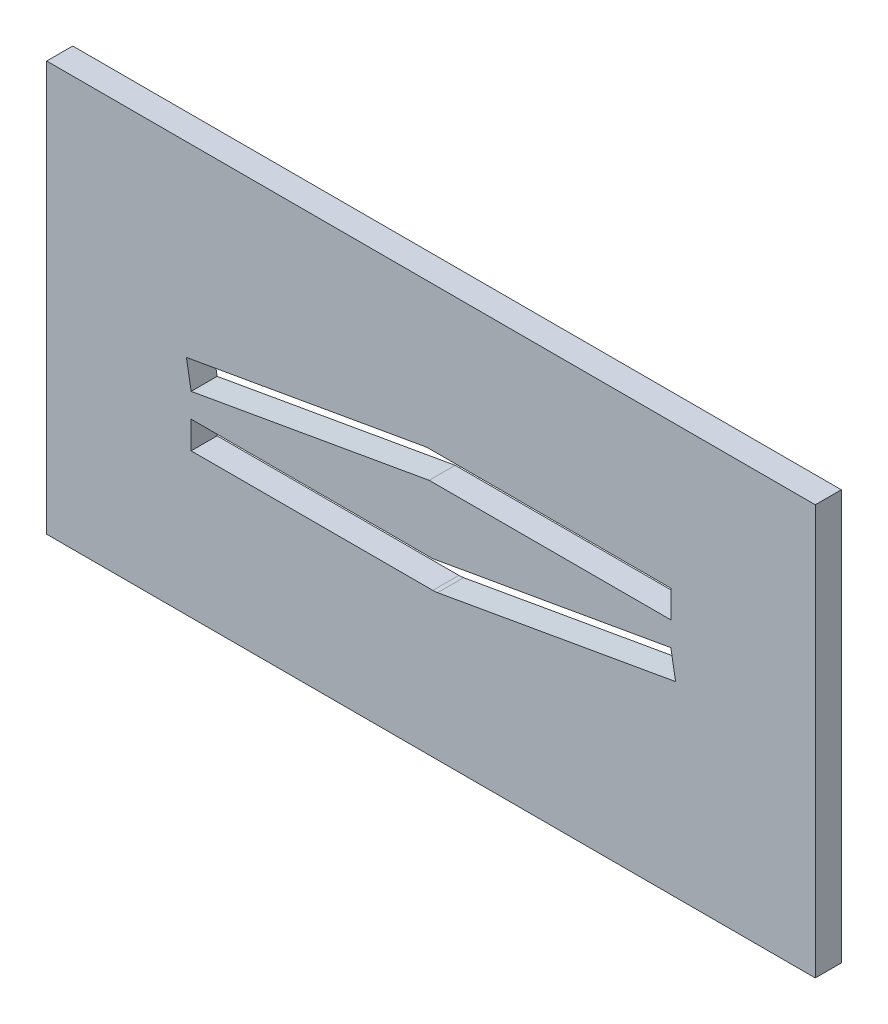
ISO-10303-21;
HEADER;
FILE_DESCRIPTION(('STEP AP214'),'2;1');
FILE_NAME('part.step','',(''),(''),'','','');
FILE_SCHEMA(('AUTOMOTIVE_DESIGN { 1 0 10303 214 1 1 1 1 }'));
ENDSEC;
DATA;
#1=APPLICATION_CONTEXT('core data for automotive mechanical design processes');
#2=APPLICATION_PROTOCOL_DEFINITION('international standard','automotive_design',2000,#1);
#3=PRODUCT_CONTEXT('',#1,'mechanical');
#4=PRODUCT('Part','Part','',(#3));
#5=PRODUCT_RELATED_PRODUCT_CATEGORY('part','',(#4));
#6=PRODUCT_DEFINITION_FORMATION('','',#4);
#7=PRODUCT_DEFINITION_CONTEXT('part definition',#1,'design');
#8=PRODUCT_DEFINITION('design','',#6,#7);
#9=PRODUCT_DEFINITION_SHAPE('','',#8);
#10=(LENGTH_UNIT() NAMED_UNIT(*) SI_UNIT(.MILLI.,.METRE.));
#11=(NAMED_UNIT(*) PLANE_ANGLE_UNIT() SI_UNIT($,.RADIAN.));
#12=(NAMED_UNIT(*) SI_UNIT($,.STERADIAN.) SOLID_ANGLE_UNIT());
#13=UNCERTAINTY_MEASURE_WITH_UNIT(LENGTH_MEASURE(1.E-05),#10,'distance_accuracy_value','');
#14=(GEOMETRIC_REPRESENTATION_CONTEXT(3) GLOBAL_UNCERTAINTY_ASSIGNED_CONTEXT((#13)) GLOBAL_UNIT_ASSIGNED_CONTEXT((#10,
#11,#12)) REPRESENTATION_CONTEXT('',''));
#15=CARTESIAN_POINT('',(0.,0.,0.));
#16=DIRECTION('',(0.,0.,1.));
#17=DIRECTION('',(1.,0.,0.));
#18=AXIS2_PLACEMENT_3D('',#15,#16,#17);
#19=CARTESIAN_POINT('',(0.,0.,2.7));
#20=DIRECTION('',(0.,0.,1.));
#21=DIRECTION('',(1.,0.,0.));
#22=AXIS2_PLACEMENT_3D('',#19,#20,#21);
#23=PLANE('',#22);
#24=DIRECTION('',(0.,-1.,0.));
#25=VECTOR('',#24,1.);
#26=CARTESIAN_POINT('',(-39.9048674522936,21.2788935686915,2.7));
#27=LINE('',#26,#25);
#28=CARTESIAN_POINT('',(-39.9048674522936,21.2788935686915,2.7));
#29=VERTEX_POINT('',#28);
#30=CARTESIAN_POINT('',(-39.9048674522936,-21.2788935686915,2.7));
#31=VERTEX_POINT('',#30);
#32=EDGE_CURVE('E270',#29,#31,#27,.T.);
#33=ORIENTED_EDGE('',*,*,#32,.T.);
#34=DIRECTION('',(1.,0.,0.));
#35=VECTOR('',#34,1.);
#36=CARTESIAN_POINT('',(-39.9048674522936,-21.2788935686915,2.7));
#37=LINE('',#36,#35);
#38=CARTESIAN_POINT('',(39.9048674522936,-21.2788935686915,2.7));
#39=VERTEX_POINT('',#38);
#40=EDGE_CURVE('E273',#31,#39,#37,.T.);
#41=ORIENTED_EDGE('',*,*,#40,.T.);
#42=DIRECTION('',(0.,1.,0.));
#43=VECTOR('',#42,1.);
#44=CARTESIAN_POINT('',(39.9048674522936,21.2788935686915,2.7));
#45=LINE('',#44,#43);
#46=CARTESIAN_POINT('',(39.9048674522936,21.2788935686915,2.7));
#47=VERTEX_POINT('',#46);
#48=EDGE_CURVE('E276',#39,#47,#45,.T.);
#49=ORIENTED_EDGE('',*,*,#48,.T.);
#50=DIRECTION('',(-1.,0.,0.));
#51=VECTOR('',#50,1.);
#52=CARTESIAN_POINT('',(-39.9048674522936,21.2788935686915,2.7));
#53=LINE('',#52,#51);
#54=EDGE_CURVE('E278',#47,#29,#53,.T.);
#55=ORIENTED_EDGE('',*,*,#54,.T.);
#56=EDGE_LOOP('',(#33,#41,#49,#55));
#57=FACE_BOUND('',#56,.T.);
#58=DIRECTION('',(-0.984807753012208,-0.173648177666931,0.));
#59=VECTOR('',#58,1.);
#60=CARTESIAN_POINT('',(-25.3997647586444,1.87780852739333,2.7));
#61=LINE('',#60,#59);
#62=CARTESIAN_POINT('',(-0.685525792640803,6.23559566477625,2.7));
#63=VERTEX_POINT('',#62);
#64=CARTESIAN_POINT('',(-25.3997647586444,1.87780852739333,2.7));
#65=VERTEX_POINT('',#64);
#66=EDGE_CURVE('E220',#63,#65,#61,.T.);
#67=ORIENTED_EDGE('',*,*,#66,.F.);
#68=DIRECTION('',(-0.996194698091746,-0.0871557427476577,0.));
#69=VECTOR('',#68,1.);
#70=CARTESIAN_POINT('',(-0.685525792640803,6.23559566477625,2.7));
#71=LINE('',#70,#69);
#72=CARTESIAN_POINT('',(-0.19062848629005,6.27889356869146,2.7));
#73=VERTEX_POINT('',#72);
#74=EDGE_CURVE('E218',#73,#63,#71,.T.);
#75=ORIENTED_EDGE('',*,*,#74,.F.);
#76=DIRECTION('',(-1.,0.,0.));
#77=VECTOR('',#76,1.);
#78=CARTESIAN_POINT('',(-0.19062848629005,6.27889356869146,2.7));
#79=LINE('',#78,#77);
#80=CARTESIAN_POINT('',(24.9048674522936,6.27889356869146,2.7));
#81=VERTEX_POINT('',#80);
#82=EDGE_CURVE('E232',#81,#73,#79,.T.);
#83=ORIENTED_EDGE('',*,*,#82,.F.);
#84=DIRECTION('',(0.,1.,0.));
#85=VECTOR('',#84,1.);
#86=CARTESIAN_POINT('',(24.9048674522936,3.42889356869146,2.7));
#87=LINE('',#86,#85);
#88=CARTESIAN_POINT('',(24.9048674522936,3.42889356869146,2.7));
#89=VERTEX_POINT('',#88);
#90=EDGE_CURVE('E229',#89,#81,#87,.T.);
#91=ORIENTED_EDGE('',*,*,#90,.F.);
#92=DIRECTION('',(1.,0.,0.));
#93=VECTOR('',#92,1.);
#94=CARTESIAN_POINT('',(-0.19062848629005,3.42889356869146,2.7));
#95=LINE('',#94,#93);
#96=CARTESIAN_POINT('',(-0.19062848629005,3.42889356869146,2.7));
#97=VERTEX_POINT('',#96);
#98=EDGE_CURVE('E227',#97,#89,#95,.T.);
#99=ORIENTED_EDGE('',*,*,#98,.F.);
#100=DIRECTION('',(0.984807753012208,0.173648177666931,0.));
#101=VECTOR('',#100,1.);
#102=CARTESIAN_POINT('',(-24.9048674522936,-0.928893568691461,2.7));
#103=LINE('',#102,#101);
#104=CARTESIAN_POINT('',(-24.9048674522936,-0.928893568691461,2.7));
#105=VERTEX_POINT('',#104);
#106=EDGE_CURVE('E225',#105,#97,#103,.T.);
#107=ORIENTED_EDGE('',*,*,#106,.F.);
#108=DIRECTION('',(0.173648177666933,-0.984807753012208,0.));
#109=VECTOR('',#108,1.);
#110=CARTESIAN_POINT('',(-24.9048674522936,-0.928893568691461,2.7));
#111=LINE('',#110,#109);
#112=EDGE_CURVE('E223',#65,#105,#111,.T.);
#113=ORIENTED_EDGE('',*,*,#112,.F.);
#114=EDGE_LOOP('',(#67,#75,#83,#91,#99,#107,#113));
#115=FACE_BOUND('',#114,.T.);
#116=DIRECTION('',(-0.984807753012208,-0.173648177666931,0.));
#117=VECTOR('',#116,1.);
#118=CARTESIAN_POINT('',(0.190628486290044,-3.42889356869146,2.7));
#119=LINE('',#118,#117);
#120=CARTESIAN_POINT('',(24.9048674522936,0.928893568691459,2.7));
#121=VERTEX_POINT('',#120);
#122=CARTESIAN_POINT('',(0.190628486290044,-3.42889356869146,2.7));
#123=VERTEX_POINT('',#122);
#124=EDGE_CURVE('E168',#121,#123,#119,.T.);
#125=ORIENTED_EDGE('',*,*,#124,.F.);
#126=DIRECTION('',(-0.173648177666932,0.984807753012208,0.));
#127=VECTOR('',#126,1.);
#128=CARTESIAN_POINT('',(24.9048674522936,0.928893568691459,2.7));
#129=LINE('',#128,#127);
#130=CARTESIAN_POINT('',(25.3997647586444,-1.87780852739333,2.7));
#131=VERTEX_POINT('',#130);
#132=EDGE_CURVE('E160',#131,#121,#129,.T.);
#133=ORIENTED_EDGE('',*,*,#132,.F.);
#134=DIRECTION('',(0.984807753012208,0.173648177666931,0.));
#135=VECTOR('',#134,1.);
#136=CARTESIAN_POINT('',(0.685525792640796,-6.23559566477625,2.7));
#137=LINE('',#136,#135);
#138=CARTESIAN_POINT('',(0.685525792640796,-6.23559566477625,2.7));
#139=VERTEX_POINT('',#138);
#140=EDGE_CURVE('E191',#139,#131,#137,.T.);
#141=ORIENTED_EDGE('',*,*,#140,.F.);
#142=DIRECTION('',(0.996194698091746,0.0871557427476577,0.));
#143=VECTOR('',#142,1.);
#144=CARTESIAN_POINT('',(0.190628486290044,-6.27889356869146,2.7));
#145=LINE('',#144,#143);
#146=CARTESIAN_POINT('',(0.190628486290044,-6.27889356869146,2.7));
#147=VERTEX_POINT('',#146);
#148=EDGE_CURVE('E189',#147,#139,#145,.T.);
#149=ORIENTED_EDGE('',*,*,#148,.F.);
#150=DIRECTION('',(1.,0.,0.));
#151=VECTOR('',#150,1.);
#152=CARTESIAN_POINT('',(-24.9048674522936,-6.27889356869146,2.7));
#153=LINE('',#152,#151);
#154=CARTESIAN_POINT('',(-24.9048674522936,-6.27889356869146,2.7));
#155=VERTEX_POINT('',#154);
#156=EDGE_CURVE('E187',#155,#147,#153,.T.);
#157=ORIENTED_EDGE('',*,*,#156,.F.);
#158=DIRECTION('',(0.,-1.,0.));
#159=VECTOR('',#158,1.);
#160=CARTESIAN_POINT('',(-24.9048674522936,-3.42889356869146,2.7));
#161=LINE('',#160,#159);
#162=CARTESIAN_POINT('',(-24.9048674522936,-3.42889356869146,2.7));
#163=VERTEX_POINT('',#162);
#164=EDGE_CURVE('E183',#163,#155,#161,.T.);
#165=ORIENTED_EDGE('',*,*,#164,.F.);
#166=DIRECTION('',(-1.,0.,0.));
#167=VECTOR('',#166,1.);
#168=CARTESIAN_POINT('',(-24.9048674522936,-3.42889356869146,2.7));
#169=LINE('',#168,#167);
#170=EDGE_CURVE('E181',#123,#163,#169,.T.);
#171=ORIENTED_EDGE('',*,*,#170,.F.);
#172=EDGE_LOOP('',(#125,#133,#141,#149,#157,#165,#171));
#173=FACE_BOUND('',#172,.T.);
#174=ADVANCED_FACE('F35',(#57,#115,#173),#23,.T.);
#175=CARTESIAN_POINT('',(0.,0.,0.));
#176=DIRECTION('',(0.,0.,1.));
#177=DIRECTION('',(1.,0.,0.));
#178=AXIS2_PLACEMENT_3D('',#175,#176,#177);
#179=PLANE('',#178);
#180=DIRECTION('',(-0.996194698091746,-0.0871557427476577,0.));
#181=VECTOR('',#180,1.);
#182=CARTESIAN_POINT('',(-0.685525792640803,6.23559566477625,0.));
#183=LINE('',#182,#181);
#184=CARTESIAN_POINT('',(-0.19062848629005,6.27889356869146,0.));
#185=VERTEX_POINT('',#184);
#186=CARTESIAN_POINT('',(-0.685525792640803,6.23559566477625,0.));
#187=VERTEX_POINT('',#186);
#188=EDGE_CURVE('E176',#185,#187,#183,.T.);
#189=ORIENTED_EDGE('',*,*,#188,.T.);
#190=DIRECTION('',(-0.984807753012208,-0.173648177666931,0.));
#191=VECTOR('',#190,1.);
#192=CARTESIAN_POINT('',(-25.3997647586444,1.87780852739333,0.));
#193=LINE('',#192,#191);
#194=CARTESIAN_POINT('',(-25.3997647586444,1.87780852739333,0.));
#195=VERTEX_POINT('',#194);
#196=EDGE_CURVE('E237',#187,#195,#193,.T.);
#197=ORIENTED_EDGE('',*,*,#196,.T.);
#198=DIRECTION('',(0.173648177666933,-0.984807753012208,0.));
#199=VECTOR('',#198,1.);
#200=CARTESIAN_POINT('',(-24.9048674522936,-0.928893568691461,0.));
#201=LINE('',#200,#199);
#202=CARTESIAN_POINT('',(-24.9048674522936,-0.928893568691461,0.));
#203=VERTEX_POINT('',#202);
#204=EDGE_CURVE('E240',#195,#203,#201,.T.);
#205=ORIENTED_EDGE('',*,*,#204,.T.);
#206=DIRECTION('',(0.984807753012208,0.173648177666931,0.));
#207=VECTOR('',#206,1.);
#208=CARTESIAN_POINT('',(-24.9048674522936,-0.928893568691461,0.));
#209=LINE('',#208,#207);
#210=CARTESIAN_POINT('',(-0.19062848629005,3.42889356869146,0.));
#211=VERTEX_POINT('',#210);
#212=EDGE_CURVE('E243',#203,#211,#209,.T.);
#213=ORIENTED_EDGE('',*,*,#212,.T.);
#214=DIRECTION('',(1.,0.,0.));
#215=VECTOR('',#214,1.);
#216=CARTESIAN_POINT('',(-0.19062848629005,3.42889356869146,0.));
#217=LINE('',#216,#215);
#218=CARTESIAN_POINT('',(24.9048674522936,3.42889356869146,0.));
#219=VERTEX_POINT('',#218);
#220=EDGE_CURVE('E246',#211,#219,#217,.T.);
#221=ORIENTED_EDGE('',*,*,#220,.T.);
#222=DIRECTION('',(0.,1.,0.));
#223=VECTOR('',#222,1.);
#224=CARTESIAN_POINT('',(24.9048674522936,3.42889356869146,0.));
#225=LINE('',#224,#223);
#226=CARTESIAN_POINT('',(24.9048674522936,6.27889356869146,0.));
#227=VERTEX_POINT('',#226);
#228=EDGE_CURVE('E249',#219,#227,#225,.T.);
#229=ORIENTED_EDGE('',*,*,#228,.T.);
#230=DIRECTION('',(-1.,0.,0.));
#231=VECTOR('',#230,1.);
#232=CARTESIAN_POINT('',(-0.19062848629005,6.27889356869146,0.));
#233=LINE('',#232,#231);
#234=EDGE_CURVE('E221',#227,#185,#233,.T.);
#235=ORIENTED_EDGE('',*,*,#234,.T.);
#236=EDGE_LOOP('',(#189,#197,#205,#213,#221,#229,#235));
#237=FACE_BOUND('',#236,.T.);
#238=DIRECTION('',(0.,-1.,0.));
#239=VECTOR('',#238,1.);
#240=CARTESIAN_POINT('',(-39.9048674522936,21.2788935686915,0.));
#241=LINE('',#240,#239);
#242=CARTESIAN_POINT('',(-39.9048674522936,21.2788935686915,0.));
#243=VERTEX_POINT('',#242);
#244=CARTESIAN_POINT('',(-39.9048674522936,-21.2788935686915,0.));
#245=VERTEX_POINT('',#244);
#246=EDGE_CURVE('E269',#243,#245,#241,.T.);
#247=ORIENTED_EDGE('',*,*,#246,.F.);
#248=DIRECTION('',(-1.,0.,0.));
#249=VECTOR('',#248,1.);
#250=CARTESIAN_POINT('',(-39.9048674522936,21.2788935686915,0.));
#251=LINE('',#250,#249);
#252=CARTESIAN_POINT('',(39.9048674522936,21.2788935686915,0.));
#253=VERTEX_POINT('',#252);
#254=EDGE_CURVE('E274',#253,#243,#251,.T.);
#255=ORIENTED_EDGE('',*,*,#254,.F.);
#256=DIRECTION('',(0.,1.,0.));
#257=VECTOR('',#256,1.);
#258=CARTESIAN_POINT('',(39.9048674522936,21.2788935686915,0.));
#259=LINE('',#258,#257);
#260=CARTESIAN_POINT('',(39.9048674522936,-21.2788935686915,0.));
#261=VERTEX_POINT('',#260);
#262=EDGE_CURVE('E285',#261,#253,#259,.T.);
#263=ORIENTED_EDGE('',*,*,#262,.F.);
#264=DIRECTION('',(1.,0.,0.));
#265=VECTOR('',#264,1.);
#266=CARTESIAN_POINT('',(-39.9048674522936,-21.2788935686915,0.));
#267=LINE('',#266,#265);
#268=EDGE_CURVE('E283',#245,#261,#267,.T.);
#269=ORIENTED_EDGE('',*,*,#268,.F.);
#270=EDGE_LOOP('',(#247,#255,#263,#269));
#271=FACE_BOUND('',#270,.T.);
#272=DIRECTION('',(-0.173648177666932,0.984807753012208,0.));
#273=VECTOR('',#272,1.);
#274=CARTESIAN_POINT('',(24.9048674522936,0.928893568691459,0.));
#275=LINE('',#274,#273);
#276=CARTESIAN_POINT('',(25.3997647586444,-1.87780852739333,0.));
#277=VERTEX_POINT('',#276);
#278=CARTESIAN_POINT('',(24.9048674522936,0.928893568691459,0.));
#279=VERTEX_POINT('',#278);
#280=EDGE_CURVE('E58',#277,#279,#275,.T.);
#281=ORIENTED_EDGE('',*,*,#280,.T.);
#282=DIRECTION('',(-0.984807753012208,-0.173648177666931,0.));
#283=VECTOR('',#282,1.);
#284=CARTESIAN_POINT('',(0.190628486290044,-3.42889356869146,0.));
#285=LINE('',#284,#283);
#286=CARTESIAN_POINT('',(0.190628486290044,-3.42889356869146,0.));
#287=VERTEX_POINT('',#286);
#288=EDGE_CURVE('E175',#279,#287,#285,.T.);
#289=ORIENTED_EDGE('',*,*,#288,.T.);
#290=DIRECTION('',(-1.,0.,0.));
#291=VECTOR('',#290,1.);
#292=CARTESIAN_POINT('',(-24.9048674522936,-3.42889356869146,0.));
#293=LINE('',#292,#291);
#294=CARTESIAN_POINT('',(-24.9048674522936,-3.42889356869146,0.));
#295=VERTEX_POINT('',#294);
#296=EDGE_CURVE('E195',#287,#295,#293,.T.);
#297=ORIENTED_EDGE('',*,*,#296,.T.);
#298=DIRECTION('',(0.,-1.,0.));
#299=VECTOR('',#298,1.);
#300=CARTESIAN_POINT('',(-24.9048674522936,-3.42889356869146,0.));
#301=LINE('',#300,#299);
#302=CARTESIAN_POINT('',(-24.9048674522936,-6.27889356869146,0.));
#303=VERTEX_POINT('',#302);
#304=EDGE_CURVE('E198',#295,#303,#301,.T.);
#305=ORIENTED_EDGE('',*,*,#304,.T.);
#306=DIRECTION('',(1.,0.,0.));
#307=VECTOR('',#306,1.);
#308=CARTESIAN_POINT('',(-24.9048674522936,-6.27889356869146,0.));
#309=LINE('',#308,#307);
#310=CARTESIAN_POINT('',(0.190628486290044,-6.27889356869146,0.));
#311=VERTEX_POINT('',#310);
#312=EDGE_CURVE('E201',#303,#311,#309,.T.);
#313=ORIENTED_EDGE('',*,*,#312,.T.);
#314=DIRECTION('',(0.996194698091746,0.0871557427476577,0.));
#315=VECTOR('',#314,1.);
#316=CARTESIAN_POINT('',(0.190628486290044,-6.27889356869146,0.));
#317=LINE('',#316,#315);
#318=CARTESIAN_POINT('',(0.685525792640796,-6.23559566477625,0.));
#319=VERTEX_POINT('',#318);
#320=EDGE_CURVE('E204',#311,#319,#317,.T.);
#321=ORIENTED_EDGE('',*,*,#320,.T.);
#322=DIRECTION('',(0.984807753012208,0.173648177666931,0.));
#323=VECTOR('',#322,1.);
#324=CARTESIAN_POINT('',(0.685525792640796,-6.23559566477625,0.));
#325=LINE('',#324,#323);
#326=EDGE_CURVE('E169',#319,#277,#325,.T.);
#327=ORIENTED_EDGE('',*,*,#326,.T.);
#328=EDGE_LOOP('',(#281,#289,#297,#305,#313,#321,#327));
#329=FACE_BOUND('',#328,.T.);
#330=ADVANCED_FACE('F303',(#237,#271,#329),#179,.F.);
#331=CARTESIAN_POINT('',(-39.9048674522936,21.2788935686915,2.7));
#332=DIRECTION('',(1.,0.,0.));
#333=DIRECTION('',(0.,0.,-1.));
#334=AXIS2_PLACEMENT_3D('',#331,#332,#333);
#335=PLANE('',#334);
#336=ORIENTED_EDGE('',*,*,#246,.T.);
#337=DIRECTION('',(0.,0.,-1.));
#338=VECTOR('',#337,1.);
#339=CARTESIAN_POINT('',(-39.9048674522936,-21.2788935686915,2.7));
#340=LINE('',#339,#338);
#341=EDGE_CURVE('E11',#31,#245,#340,.T.);
#342=ORIENTED_EDGE('',*,*,#341,.F.);
#343=ORIENTED_EDGE('',*,*,#32,.F.);
#344=DIRECTION('',(0.,0.,-1.));
#345=VECTOR('',#344,1.);
#346=CARTESIAN_POINT('',(-39.9048674522936,21.2788935686915,2.7));
#347=LINE('',#346,#345);
#348=EDGE_CURVE('E280',#29,#243,#347,.T.);
#349=ORIENTED_EDGE('',*,*,#348,.T.);
#350=EDGE_LOOP('',(#336,#342,#343,#349));
#351=FACE_BOUND('',#350,.T.);
#352=ADVANCED_FACE('F37',(#351),#335,.F.);
#353=CARTESIAN_POINT('',(-39.9048674522936,-21.2788935686915,2.7));
#354=DIRECTION('',(0.,1.,0.));
#355=DIRECTION('',(0.,0.,1.));
#356=AXIS2_PLACEMENT_3D('',#353,#354,#355);
#357=PLANE('',#356);
#358=ORIENTED_EDGE('',*,*,#268,.T.);
#359=DIRECTION('',(0.,0.,-1.));
#360=VECTOR('',#359,1.);
#361=CARTESIAN_POINT('',(39.9048674522936,-21.2788935686915,2.7));
#362=LINE('',#361,#360);
#363=EDGE_CURVE('E43',#39,#261,#362,.T.);
#364=ORIENTED_EDGE('',*,*,#363,.F.);
#365=ORIENTED_EDGE('',*,*,#40,.F.);
#366=ORIENTED_EDGE('',*,*,#341,.T.);
#367=EDGE_LOOP('',(#358,#364,#365,#366));
#368=FACE_BOUND('',#367,.T.);
#369=ADVANCED_FACE('F314',(#368),#357,.F.);
#370=CARTESIAN_POINT('',(39.9048674522936,21.2788935686915,2.7));
#371=DIRECTION('',(-1.,0.,0.));
#372=DIRECTION('',(0.,0.,1.));
#373=AXIS2_PLACEMENT_3D('',#370,#371,#372);
#374=PLANE('',#373);
#375=ORIENTED_EDGE('',*,*,#262,.T.);
#376=DIRECTION('',(0.,0.,-1.));
#377=VECTOR('',#376,1.);
#378=CARTESIAN_POINT('',(39.9048674522936,21.2788935686915,2.7));
#379=LINE('',#378,#377);
#380=EDGE_CURVE('E290',#47,#253,#379,.T.);
#381=ORIENTED_EDGE('',*,*,#380,.F.);
#382=ORIENTED_EDGE('',*,*,#48,.F.);
#383=ORIENTED_EDGE('',*,*,#363,.T.);
#384=EDGE_LOOP('',(#375,#381,#382,#383));
#385=FACE_BOUND('',#384,.T.);
#386=ADVANCED_FACE('F297',(#385),#374,.F.);
#387=CARTESIAN_POINT('',(-39.9048674522936,21.2788935686915,2.7));
#388=DIRECTION('',(0.,-1.,0.));
#389=DIRECTION('',(0.,0.,-1.));
#390=AXIS2_PLACEMENT_3D('',#387,#388,#389);
#391=PLANE('',#390);
#392=ORIENTED_EDGE('',*,*,#254,.T.);
#393=ORIENTED_EDGE('',*,*,#348,.F.);
#394=ORIENTED_EDGE('',*,*,#54,.F.);
#395=ORIENTED_EDGE('',*,*,#380,.T.);
#396=EDGE_LOOP('',(#392,#393,#394,#395));
#397=FACE_BOUND('',#396,.T.);
#398=ADVANCED_FACE('F307',(#397),#391,.F.);
#399=CARTESIAN_POINT('',(-0.685525792640803,6.23559566477625,2.7));
#400=DIRECTION('',(0.0871557427476577,-0.996194698091746,0.));
#401=DIRECTION('',(0.996194698091746,0.0871557427476577,0.));
#402=AXIS2_PLACEMENT_3D('',#399,#400,#401);
#403=PLANE('',#402);
#404=ORIENTED_EDGE('',*,*,#188,.F.);
#405=DIRECTION('',(0.,0.,-1.));
#406=VECTOR('',#405,1.);
#407=CARTESIAN_POINT('',(-0.19062848629005,6.27889356869146,2.7));
#408=LINE('',#407,#406);
#409=EDGE_CURVE('E234',#73,#185,#408,.T.);
#410=ORIENTED_EDGE('',*,*,#409,.F.);
#411=ORIENTED_EDGE('',*,*,#74,.T.);
#412=DIRECTION('',(0.,0.,-1.));
#413=VECTOR('',#412,1.);
#414=CARTESIAN_POINT('',(-0.685525792640803,6.23559566477625,2.7));
#415=LINE('',#414,#413);
#416=EDGE_CURVE('E266',#63,#187,#415,.T.);
#417=ORIENTED_EDGE('',*,*,#416,.T.);
#418=EDGE_LOOP('',(#404,#410,#411,#417));
#419=FACE_BOUND('',#418,.T.);
#420=ADVANCED_FACE('F329',(#419),#403,.T.);
#421=CARTESIAN_POINT('',(-25.3997647586444,1.87780852739333,2.7));
#422=DIRECTION('',(0.173648177666931,-0.984807753012208,0.));
#423=DIRECTION('',(0.984807753012208,0.173648177666931,0.));
#424=AXIS2_PLACEMENT_3D('',#421,#422,#423);
#425=PLANE('',#424);
#426=ORIENTED_EDGE('',*,*,#196,.F.);
#427=ORIENTED_EDGE('',*,*,#416,.F.);
#428=ORIENTED_EDGE('',*,*,#66,.T.);
#429=DIRECTION('',(0.,0.,-1.));
#430=VECTOR('',#429,1.);
#431=CARTESIAN_POINT('',(-25.3997647586444,1.87780852739333,2.7));
#432=LINE('',#431,#430);
#433=EDGE_CURVE('E264',#65,#195,#432,.T.);
#434=ORIENTED_EDGE('',*,*,#433,.T.);
#435=EDGE_LOOP('',(#426,#427,#428,#434));
#436=FACE_BOUND('',#435,.T.);
#437=ADVANCED_FACE('F336',(#436),#425,.T.);
#438=CARTESIAN_POINT('',(-24.9048674522936,-0.928893568691461,2.7));
#439=DIRECTION('',(0.984807753012208,0.173648177666933,0.));
#440=DIRECTION('',(-0.173648177666933,0.984807753012208,0.));
#441=AXIS2_PLACEMENT_3D('',#438,#439,#440);
#442=PLANE('',#441);
#443=ORIENTED_EDGE('',*,*,#204,.F.);
#444=ORIENTED_EDGE('',*,*,#433,.F.);
#445=ORIENTED_EDGE('',*,*,#112,.T.);
#446=DIRECTION('',(0.,0.,-1.));
#447=VECTOR('',#446,1.);
#448=CARTESIAN_POINT('',(-24.9048674522936,-0.928893568691461,2.7));
#449=LINE('',#448,#447);
#450=EDGE_CURVE('E262',#105,#203,#449,.T.);
#451=ORIENTED_EDGE('',*,*,#450,.T.);
#452=EDGE_LOOP('',(#443,#444,#445,#451));
#453=FACE_BOUND('',#452,.T.);
#454=ADVANCED_FACE('F341',(#453),#442,.T.);
#455=CARTESIAN_POINT('',(-24.9048674522936,-0.928893568691461,2.7));
#456=DIRECTION('',(-0.173648177666931,0.984807753012208,0.));
#457=DIRECTION('',(-0.984807753012208,-0.173648177666931,0.));
#458=AXIS2_PLACEMENT_3D('',#455,#456,#457);
#459=PLANE('',#458);
#460=ORIENTED_EDGE('',*,*,#212,.F.);
#461=ORIENTED_EDGE('',*,*,#450,.F.);
#462=ORIENTED_EDGE('',*,*,#106,.T.);
#463=DIRECTION('',(0.,0.,-1.));
#464=VECTOR('',#463,1.);
#465=CARTESIAN_POINT('',(-0.19062848629005,3.42889356869146,2.7));
#466=LINE('',#465,#464);
#467=EDGE_CURVE('E260',#97,#211,#466,.T.);
#468=ORIENTED_EDGE('',*,*,#467,.T.);
#469=EDGE_LOOP('',(#460,#461,#462,#468));
#470=FACE_BOUND('',#469,.T.);
#471=ADVANCED_FACE('F366',(#470),#459,.T.);
#472=CARTESIAN_POINT('',(-0.19062848629005,3.42889356869146,2.7));
#473=DIRECTION('',(0.,1.,0.));
#474=DIRECTION('',(0.,0.,1.));
#475=AXIS2_PLACEMENT_3D('',#472,#473,#474);
#476=PLANE('',#475);
#477=ORIENTED_EDGE('',*,*,#220,.F.);
#478=ORIENTED_EDGE('',*,*,#467,.F.);
#479=ORIENTED_EDGE('',*,*,#98,.T.);
#480=DIRECTION('',(0.,0.,-1.));
#481=VECTOR('',#480,1.);
#482=CARTESIAN_POINT('',(24.9048674522936,3.42889356869146,2.7));
#483=LINE('',#482,#481);
#484=EDGE_CURVE('E258',#89,#219,#483,.T.);
#485=ORIENTED_EDGE('',*,*,#484,.T.);
#486=EDGE_LOOP('',(#477,#478,#479,#485));
#487=FACE_BOUND('',#486,.T.);
#488=ADVANCED_FACE('F369',(#487),#476,.T.);
#489=CARTESIAN_POINT('',(24.9048674522936,3.42889356869146,2.7));
#490=DIRECTION('',(-1.,0.,0.));
#491=DIRECTION('',(0.,0.,1.));
#492=AXIS2_PLACEMENT_3D('',#489,#490,#491);
#493=PLANE('',#492);
#494=ORIENTED_EDGE('',*,*,#228,.F.);
#495=ORIENTED_EDGE('',*,*,#484,.F.);
#496=ORIENTED_EDGE('',*,*,#90,.T.);
#497=DIRECTION('',(0.,0.,-1.));
#498=VECTOR('',#497,1.);
#499=CARTESIAN_POINT('',(24.9048674522936,6.27889356869146,2.7));
#500=LINE('',#499,#498);
#501=EDGE_CURVE('E256',#81,#227,#500,.T.);
#502=ORIENTED_EDGE('',*,*,#501,.T.);
#503=EDGE_LOOP('',(#494,#495,#496,#502));
#504=FACE_BOUND('',#503,.T.);
#505=ADVANCED_FACE('F354',(#504),#493,.T.);
#506=CARTESIAN_POINT('',(-0.19062848629005,6.27889356869146,2.7));
#507=DIRECTION('',(0.,-1.,0.));
#508=DIRECTION('',(0.,0.,-1.));
#509=AXIS2_PLACEMENT_3D('',#506,#507,#508);
#510=PLANE('',#509);
#511=ORIENTED_EDGE('',*,*,#234,.F.);
#512=ORIENTED_EDGE('',*,*,#501,.F.);
#513=ORIENTED_EDGE('',*,*,#82,.T.);
#514=ORIENTED_EDGE('',*,*,#409,.T.);
#515=EDGE_LOOP('',(#511,#512,#513,#514));
#516=FACE_BOUND('',#515,.T.);
#517=ADVANCED_FACE('F348',(#516),#510,.T.);
#518=CARTESIAN_POINT('',(24.9048674522936,0.928893568691459,2.7));
#519=DIRECTION('',(-0.984807753012208,-0.173648177666931,0.));
#520=DIRECTION('',(0.173648177666932,-0.984807753012208,0.));
#521=AXIS2_PLACEMENT_3D('',#518,#519,#520);
#522=PLANE('',#521);
#523=ORIENTED_EDGE('',*,*,#280,.F.);
#524=DIRECTION('',(0.,0.,-1.));
#525=VECTOR('',#524,1.);
#526=CARTESIAN_POINT('',(25.3997647586444,-1.87780852739333,2.7));
#527=LINE('',#526,#525);
#528=EDGE_CURVE('E164',#131,#277,#527,.T.);
#529=ORIENTED_EDGE('',*,*,#528,.F.);
#530=ORIENTED_EDGE('',*,*,#132,.T.);
#531=DIRECTION('',(0.,0.,-1.));
#532=VECTOR('',#531,1.);
#533=CARTESIAN_POINT('',(24.9048674522936,0.928893568691459,2.7));
#534=LINE('',#533,#532);
#535=EDGE_CURVE('E163',#121,#279,#534,.T.);
#536=ORIENTED_EDGE('',*,*,#535,.T.);
#537=EDGE_LOOP('',(#523,#529,#530,#536));
#538=FACE_BOUND('',#537,.T.);
#539=ADVANCED_FACE('F162',(#538),#522,.T.);
#540=CARTESIAN_POINT('',(0.190628486290044,-3.42889356869146,2.7));
#541=DIRECTION('',(0.173648177666931,-0.984807753012208,0.));
#542=DIRECTION('',(0.984807753012208,0.173648177666931,0.));
#543=AXIS2_PLACEMENT_3D('',#540,#541,#542);
#544=PLANE('',#543);
#545=ORIENTED_EDGE('',*,*,#288,.F.);
#546=ORIENTED_EDGE('',*,*,#535,.F.);
#547=ORIENTED_EDGE('',*,*,#124,.T.);
#548=DIRECTION('',(0.,0.,-1.));
#549=VECTOR('',#548,1.);
#550=CARTESIAN_POINT('',(0.190628486290044,-3.42889356869146,2.7));
#551=LINE('',#550,#549);
#552=EDGE_CURVE('E177',#123,#287,#551,.T.);
#553=ORIENTED_EDGE('',*,*,#552,.T.);
#554=EDGE_LOOP('',(#545,#546,#547,#553));
#555=FACE_BOUND('',#554,.T.);
#556=ADVANCED_FACE('F172',(#555),#544,.T.);
#557=CARTESIAN_POINT('',(-24.9048674522936,-3.42889356869146,2.7));
#558=DIRECTION('',(0.,-1.,0.));
#559=DIRECTION('',(0.,0.,-1.));
#560=AXIS2_PLACEMENT_3D('',#557,#558,#559);
#561=PLANE('',#560);
#562=ORIENTED_EDGE('',*,*,#296,.F.);
#563=ORIENTED_EDGE('',*,*,#552,.F.);
#564=ORIENTED_EDGE('',*,*,#170,.T.);
#565=DIRECTION('',(0.,0.,-1.));
#566=VECTOR('',#565,1.);
#567=CARTESIAN_POINT('',(-24.9048674522936,-3.42889356869146,2.7));
#568=LINE('',#567,#566);
#569=EDGE_CURVE('E215',#163,#295,#568,.T.);
#570=ORIENTED_EDGE('',*,*,#569,.T.);
#571=EDGE_LOOP('',(#562,#563,#564,#570));
#572=FACE_BOUND('',#571,.T.);
#573=ADVANCED_FACE('F423',(#572),#561,.T.);
#574=CARTESIAN_POINT('',(-24.9048674522936,-3.42889356869146,2.7));
#575=DIRECTION('',(1.,0.,0.));
#576=DIRECTION('',(0.,0.,-1.));
#577=AXIS2_PLACEMENT_3D('',#574,#575,#576);
#578=PLANE('',#577);
#579=ORIENTED_EDGE('',*,*,#304,.F.);
#580=ORIENTED_EDGE('',*,*,#569,.F.);
#581=ORIENTED_EDGE('',*,*,#164,.T.);
#582=DIRECTION('',(0.,0.,-1.));
#583=VECTOR('',#582,1.);
#584=CARTESIAN_POINT('',(-24.9048674522936,-6.27889356869146,2.7));
#585=LINE('',#584,#583);
#586=EDGE_CURVE('E213',#155,#303,#585,.T.);
#587=ORIENTED_EDGE('',*,*,#586,.T.);
#588=EDGE_LOOP('',(#579,#580,#581,#587));
#589=FACE_BOUND('',#588,.T.);
#590=ADVANCED_FACE('F432',(#589),#578,.T.);
#591=CARTESIAN_POINT('',(-24.9048674522936,-6.27889356869146,2.7));
#592=DIRECTION('',(0.,1.,0.));
#593=DIRECTION('',(0.,0.,1.));
#594=AXIS2_PLACEMENT_3D('',#591,#592,#593);
#595=PLANE('',#594);
#596=ORIENTED_EDGE('',*,*,#312,.F.);
#597=ORIENTED_EDGE('',*,*,#586,.F.);
#598=ORIENTED_EDGE('',*,*,#156,.T.);
#599=DIRECTION('',(0.,0.,-1.));
#600=VECTOR('',#599,1.);
#601=CARTESIAN_POINT('',(0.190628486290044,-6.27889356869146,2.7));
#602=LINE('',#601,#600);
#603=EDGE_CURVE('E211',#147,#311,#602,.T.);
#604=ORIENTED_EDGE('',*,*,#603,.T.);
#605=EDGE_LOOP('',(#596,#597,#598,#604));
#606=FACE_BOUND('',#605,.T.);
#607=ADVANCED_FACE('F442',(#606),#595,.T.);
#608=CARTESIAN_POINT('',(0.190628486290044,-6.27889356869146,2.7));
#609=DIRECTION('',(-0.0871557427476577,0.996194698091746,0.));
#610=DIRECTION('',(-0.996194698091746,-0.0871557427476577,0.));
#611=AXIS2_PLACEMENT_3D('',#608,#609,#610);
#612=PLANE('',#611);
#613=ORIENTED_EDGE('',*,*,#320,.F.);
#614=ORIENTED_EDGE('',*,*,#603,.F.);
#615=ORIENTED_EDGE('',*,*,#148,.T.);
#616=DIRECTION('',(0.,0.,-1.));
#617=VECTOR('',#616,1.);
#618=CARTESIAN_POINT('',(0.685525792640796,-6.23559566477625,2.7));
#619=LINE('',#618,#617);
#620=EDGE_CURVE('E50',#139,#319,#619,.T.);
#621=ORIENTED_EDGE('',*,*,#620,.T.);
#622=EDGE_LOOP('',(#613,#614,#615,#621));
#623=FACE_BOUND('',#622,.T.);
#624=ADVANCED_FACE('F452',(#623),#612,.T.);
#625=CARTESIAN_POINT('',(0.685525792640796,-6.23559566477625,2.7));
#626=DIRECTION('',(-0.173648177666931,0.984807753012208,0.));
#627=DIRECTION('',(-0.984807753012208,-0.173648177666931,0.));
#628=AXIS2_PLACEMENT_3D('',#625,#626,#627);
#629=PLANE('',#628);
#630=ORIENTED_EDGE('',*,*,#326,.F.);
#631=ORIENTED_EDGE('',*,*,#620,.F.);
#632=ORIENTED_EDGE('',*,*,#140,.T.);
#633=ORIENTED_EDGE('',*,*,#528,.T.);
#634=EDGE_LOOP('',(#630,#631,#632,#633));
#635=FACE_BOUND('',#634,.T.);
#636=ADVANCED_FACE('F462',(#635),#629,.T.);
#637=CLOSED_SHELL('',(#174,#330,#352,#369,#386,#398,#420,#437,#454,#471,#488,#505,#517,#539,
#556,#573,#590,#607,#624,#636));
#638=MANIFOLD_SOLID_BREP('B2',#637);
#639=ADVANCED_BREP_SHAPE_REPRESENTATION('',(#18,#638),#14);
#640=SHAPE_DEFINITION_REPRESENTATION(#9,#639);
ENDSEC;
END-ISO-10303-21;
